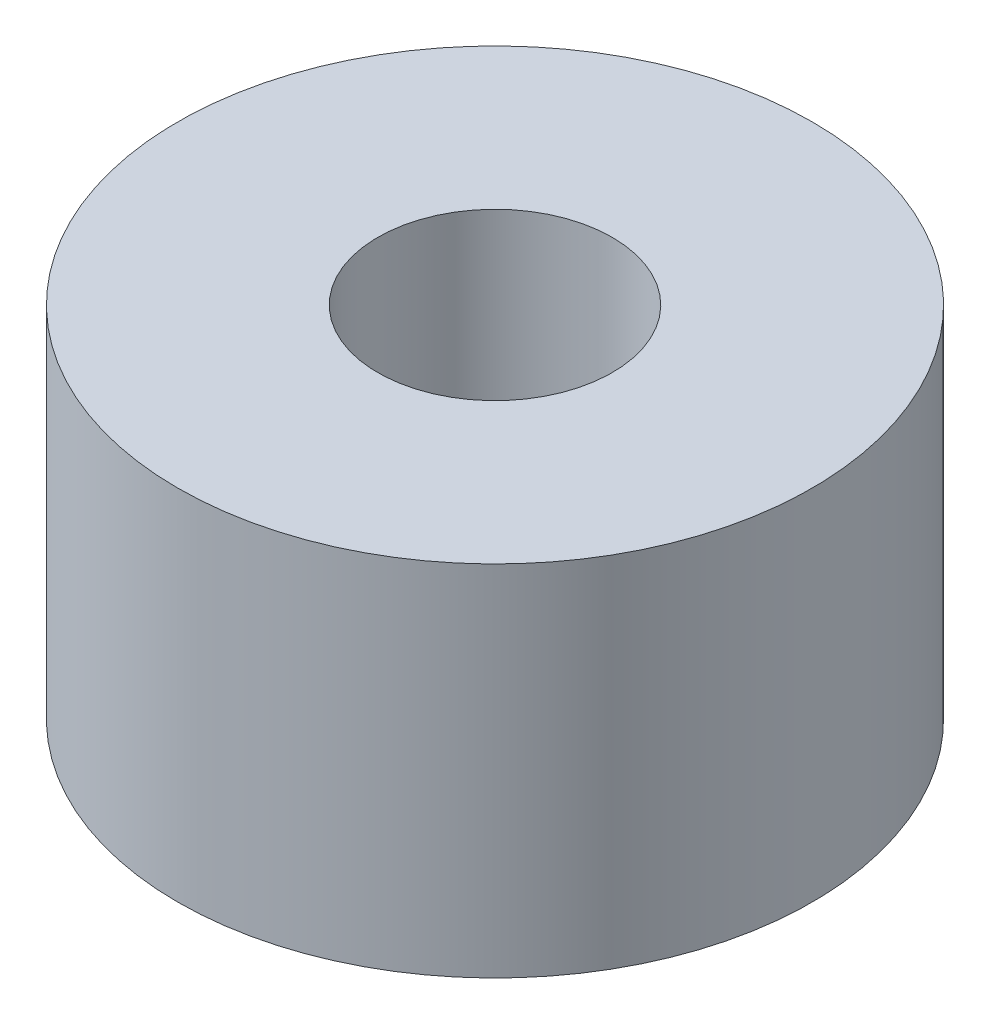
ISO-10303-21;
HEADER;
FILE_DESCRIPTION(('STEP AP214'),'2;1');
FILE_NAME('part.step','',(''),(''),'','','');
FILE_SCHEMA(('AUTOMOTIVE_DESIGN { 1 0 10303 214 1 1 1 1 }'));
ENDSEC;
DATA;
#1=APPLICATION_CONTEXT('core data for automotive mechanical design processes');
#2=APPLICATION_PROTOCOL_DEFINITION('international standard','automotive_design',2000,#1);
#3=PRODUCT_CONTEXT('',#1,'mechanical');
#4=PRODUCT('Part','Part','',(#3));
#5=PRODUCT_RELATED_PRODUCT_CATEGORY('part','',(#4));
#6=PRODUCT_DEFINITION_FORMATION('','',#4);
#7=PRODUCT_DEFINITION_CONTEXT('part definition',#1,'design');
#8=PRODUCT_DEFINITION('design','',#6,#7);
#9=PRODUCT_DEFINITION_SHAPE('','',#8);
#10=(LENGTH_UNIT() NAMED_UNIT(*) SI_UNIT(.MILLI.,.METRE.));
#11=(NAMED_UNIT(*) PLANE_ANGLE_UNIT() SI_UNIT($,.RADIAN.));
#12=(NAMED_UNIT(*) SI_UNIT($,.STERADIAN.) SOLID_ANGLE_UNIT());
#13=UNCERTAINTY_MEASURE_WITH_UNIT(LENGTH_MEASURE(1.E-05),#10,'distance_accuracy_value','');
#14=(GEOMETRIC_REPRESENTATION_CONTEXT(3) GLOBAL_UNCERTAINTY_ASSIGNED_CONTEXT((#13)) GLOBAL_UNIT_ASSIGNED_CONTEXT((#10,
#11,#12)) REPRESENTATION_CONTEXT('',''));
#15=CARTESIAN_POINT('',(0.,0.,0.));
#16=DIRECTION('',(0.,0.,1.));
#17=DIRECTION('',(1.,0.,0.));
#18=AXIS2_PLACEMENT_3D('',#15,#16,#17);
#19=CARTESIAN_POINT('',(5.9,13.2,-5.9));
#20=DIRECTION('',(0.,-1.,0.));
#21=DIRECTION('',(0.,0.,-1.));
#22=AXIS2_PLACEMENT_3D('',#19,#20,#21);
#23=CYLINDRICAL_SURFACE('',#22,2.3);
#24=CARTESIAN_POINT('',(5.9,10.6,-5.9));
#25=DIRECTION('',(0.,-1.,0.));
#26=DIRECTION('',(0.,0.,-1.));
#27=AXIS2_PLACEMENT_3D('',#24,#25,#26);
#28=CIRCLE('',#27,2.3);
#29=CARTESIAN_POINT('',(5.9,10.6,-8.2));
#30=VERTEX_POINT('',#29);
#31=EDGE_CURVE('E28',#30,#30,#28,.T.);
#32=ORIENTED_EDGE('',*,*,#31,.F.);
#33=EDGE_LOOP('',(#32));
#34=FACE_BOUND('',#33,.T.);
#35=CARTESIAN_POINT('',(5.9,13.2,-5.9));
#36=DIRECTION('',(0.,-1.,0.));
#37=DIRECTION('',(0.,0.,-1.));
#38=AXIS2_PLACEMENT_3D('',#35,#36,#37);
#39=CIRCLE('',#38,2.3);
#40=CARTESIAN_POINT('',(5.9,13.2,-8.2));
#41=VERTEX_POINT('',#40);
#42=EDGE_CURVE('E19',#41,#41,#39,.F.);
#43=ORIENTED_EDGE('',*,*,#42,.F.);
#44=EDGE_LOOP('',(#43));
#45=FACE_BOUND('',#44,.T.);
#46=ADVANCED_FACE('F15',(#34,#45),#23,.T.);
#47=CARTESIAN_POINT('',(3.554,13.2,-8.2));
#48=DIRECTION('',(0.,1.,0.));
#49=DIRECTION('',(0.,0.,1.));
#50=AXIS2_PLACEMENT_3D('',#47,#48,#49);
#51=PLANE('',#50);
#52=CARTESIAN_POINT('',(5.9,13.2,-5.9));
#53=DIRECTION('',(0.,-1.,0.));
#54=DIRECTION('',(0.,0.,-1.));
#55=AXIS2_PLACEMENT_3D('',#52,#53,#54);
#56=CIRCLE('',#55,0.850000000000001);
#57=CARTESIAN_POINT('',(5.9,13.2,-6.75));
#58=VERTEX_POINT('',#57);
#59=EDGE_CURVE('E23',#58,#58,#56,.F.);
#60=ORIENTED_EDGE('',*,*,#59,.F.);
#61=EDGE_LOOP('',(#60));
#62=FACE_BOUND('',#61,.T.);
#63=ORIENTED_EDGE('',*,*,#42,.T.);
#64=EDGE_LOOP('',(#63));
#65=FACE_BOUND('',#64,.T.);
#66=ADVANCED_FACE('F36',(#62,#65),#51,.T.);
#67=CARTESIAN_POINT('',(3.554,10.6,-3.554));
#68=DIRECTION('',(0.,-1.,0.));
#69=DIRECTION('',(0.,0.,-1.));
#70=AXIS2_PLACEMENT_3D('',#67,#68,#69);
#71=PLANE('',#70);
#72=CARTESIAN_POINT('',(5.9,10.6,-5.9));
#73=DIRECTION('',(0.,-1.,0.));
#74=DIRECTION('',(0.,0.,-1.));
#75=AXIS2_PLACEMENT_3D('',#72,#73,#74);
#76=CIRCLE('',#75,0.850000000000001);
#77=CARTESIAN_POINT('',(5.9,10.6,-6.75));
#78=VERTEX_POINT('',#77);
#79=EDGE_CURVE('E10',#78,#78,#76,.T.);
#80=ORIENTED_EDGE('',*,*,#79,.F.);
#81=EDGE_LOOP('',(#80));
#82=FACE_BOUND('',#81,.T.);
#83=ORIENTED_EDGE('',*,*,#31,.T.);
#84=EDGE_LOOP('',(#83));
#85=FACE_BOUND('',#84,.T.);
#86=ADVANCED_FACE('F45',(#82,#85),#71,.T.);
#87=CARTESIAN_POINT('',(5.9,13.2,-5.9));
#88=DIRECTION('',(0.,-1.,0.));
#89=DIRECTION('',(0.,0.,-1.));
#90=AXIS2_PLACEMENT_3D('',#87,#88,#89);
#91=CYLINDRICAL_SURFACE('',#90,0.850000000000001);
#92=ORIENTED_EDGE('',*,*,#79,.T.);
#93=EDGE_LOOP('',(#92));
#94=FACE_BOUND('',#93,.T.);
#95=ORIENTED_EDGE('',*,*,#59,.T.);
#96=EDGE_LOOP('',(#95));
#97=FACE_BOUND('',#96,.T.);
#98=ADVANCED_FACE('F17',(#94,#97),#91,.F.);
#99=CLOSED_SHELL('',(#46,#66,#86,#98));
#100=MANIFOLD_SOLID_BREP('B1',#99);
#101=ADVANCED_BREP_SHAPE_REPRESENTATION('',(#18,#100),#14);
#102=SHAPE_DEFINITION_REPRESENTATION(#9,#101);
ENDSEC;
END-ISO-10303-21;
